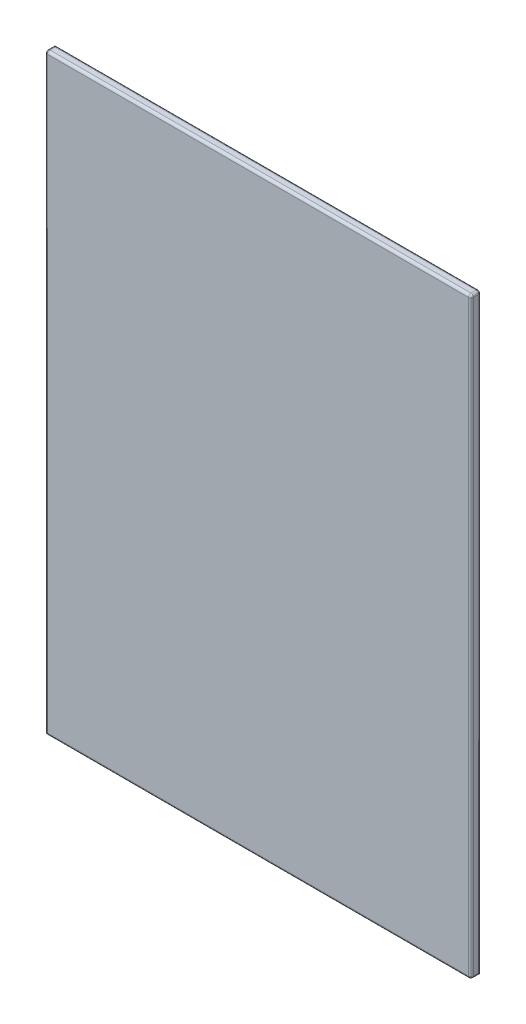
ISO-10303-21;
HEADER;
FILE_DESCRIPTION(('STEP AP214'),'2;1');
FILE_NAME('part.step','',(''),(''),'','','');
FILE_SCHEMA(('AUTOMOTIVE_DESIGN { 1 0 10303 214 1 1 1 1 }'));
ENDSEC;
DATA;
#1=APPLICATION_CONTEXT('core data for automotive mechanical design processes');
#2=APPLICATION_PROTOCOL_DEFINITION('international standard','automotive_design',2000,#1);
#3=PRODUCT_CONTEXT('',#1,'mechanical');
#4=PRODUCT('Part','Part','',(#3));
#5=PRODUCT_RELATED_PRODUCT_CATEGORY('part','',(#4));
#6=PRODUCT_DEFINITION_FORMATION('','',#4);
#7=PRODUCT_DEFINITION_CONTEXT('part definition',#1,'design');
#8=PRODUCT_DEFINITION('design','',#6,#7);
#9=PRODUCT_DEFINITION_SHAPE('','',#8);
#10=(LENGTH_UNIT() NAMED_UNIT(*) SI_UNIT(.MILLI.,.METRE.));
#11=(NAMED_UNIT(*) PLANE_ANGLE_UNIT() SI_UNIT($,.RADIAN.));
#12=(NAMED_UNIT(*) SI_UNIT($,.STERADIAN.) SOLID_ANGLE_UNIT());
#13=UNCERTAINTY_MEASURE_WITH_UNIT(LENGTH_MEASURE(1.E-05),#10,'distance_accuracy_value','');
#14=(GEOMETRIC_REPRESENTATION_CONTEXT(3) GLOBAL_UNCERTAINTY_ASSIGNED_CONTEXT((#13)) GLOBAL_UNIT_ASSIGNED_CONTEXT((#10,
#11,#12)) REPRESENTATION_CONTEXT('',''));
#15=CARTESIAN_POINT('',(0.,0.,0.));
#16=DIRECTION('',(0.,0.,1.));
#17=DIRECTION('',(1.,0.,0.));
#18=AXIS2_PLACEMENT_3D('',#15,#16,#17);
#19=CARTESIAN_POINT('',(427.5,595.,20.));
#20=DIRECTION('',(-1.,0.,0.));
#21=DIRECTION('',(0.,-1.,0.));
#22=AXIS2_PLACEMENT_3D('',#19,#20,#21);
#23=PLANE('',#22);
#24=DIRECTION('',(0.,1.,0.));
#25=VECTOR('',#24,1.);
#26=CARTESIAN_POINT('',(427.5,-595.,15.));
#27=LINE('',#26,#25);
#28=CARTESIAN_POINT('',(427.5,590.,15.));
#29=VERTEX_POINT('',#28);
#30=CARTESIAN_POINT('',(427.5,-590.,15.));
#31=VERTEX_POINT('',#30);
#32=EDGE_CURVE('E139',#29,#31,#27,.F.);
#33=ORIENTED_EDGE('',*,*,#32,.T.);
#34=DIRECTION('',(0.,0.,-1.));
#35=VECTOR('',#34,1.);
#36=CARTESIAN_POINT('',(427.5,-590.,20.));
#37=LINE('',#36,#35);
#38=CARTESIAN_POINT('',(427.5,-590.,5.));
#39=VERTEX_POINT('',#38);
#40=EDGE_CURVE('E146',#31,#39,#37,.T.);
#41=ORIENTED_EDGE('',*,*,#40,.T.);
#42=DIRECTION('',(0.,1.,0.));
#43=VECTOR('',#42,1.);
#44=CARTESIAN_POINT('',(427.5,595.,5.));
#45=LINE('',#44,#43);
#46=CARTESIAN_POINT('',(427.5,590.,5.));
#47=VERTEX_POINT('',#46);
#48=EDGE_CURVE('E142',#39,#47,#45,.T.);
#49=ORIENTED_EDGE('',*,*,#48,.T.);
#50=DIRECTION('',(0.,0.,-1.));
#51=VECTOR('',#50,1.);
#52=CARTESIAN_POINT('',(427.5,590.,20.));
#53=LINE('',#52,#51);
#54=EDGE_CURVE('E119',#47,#29,#53,.F.);
#55=ORIENTED_EDGE('',*,*,#54,.T.);
#56=EDGE_LOOP('',(#33,#41,#49,#55));
#57=FACE_BOUND('',#56,.T.);
#58=ADVANCED_FACE('F39',(#57),#23,.F.);
#59=CARTESIAN_POINT('',(-427.5,595.,20.));
#60=DIRECTION('',(0.,-1.,0.));
#61=DIRECTION('',(0.,0.,-1.));
#62=AXIS2_PLACEMENT_3D('',#59,#60,#61);
#63=PLANE('',#62);
#64=DIRECTION('',(-1.,0.,0.));
#65=VECTOR('',#64,1.);
#66=CARTESIAN_POINT('',(-427.5,595.,5.));
#67=LINE('',#66,#65);
#68=CARTESIAN_POINT('',(422.5,595.,5.));
#69=VERTEX_POINT('',#68);
#70=CARTESIAN_POINT('',(-422.5,595.,5.));
#71=VERTEX_POINT('',#70);
#72=EDGE_CURVE('E160',#69,#71,#67,.T.);
#73=ORIENTED_EDGE('',*,*,#72,.T.);
#74=DIRECTION('',(0.,0.,-1.));
#75=VECTOR('',#74,1.);
#76=CARTESIAN_POINT('',(-422.5,595.,20.));
#77=LINE('',#76,#75);
#78=CARTESIAN_POINT('',(-422.5,595.,15.));
#79=VERTEX_POINT('',#78);
#80=EDGE_CURVE('E164',#71,#79,#77,.F.);
#81=ORIENTED_EDGE('',*,*,#80,.T.);
#82=DIRECTION('',(-1.,0.,0.));
#83=VECTOR('',#82,1.);
#84=CARTESIAN_POINT('',(427.5,595.,15.));
#85=LINE('',#84,#83);
#86=CARTESIAN_POINT('',(422.5,595.,15.));
#87=VERTEX_POINT('',#86);
#88=EDGE_CURVE('E157',#79,#87,#85,.F.);
#89=ORIENTED_EDGE('',*,*,#88,.T.);
#90=DIRECTION('',(0.,0.,-1.));
#91=VECTOR('',#90,1.);
#92=CARTESIAN_POINT('',(422.5,595.,20.));
#93=LINE('',#92,#91);
#94=EDGE_CURVE('E154',#87,#69,#93,.T.);
#95=ORIENTED_EDGE('',*,*,#94,.T.);
#96=EDGE_LOOP('',(#73,#81,#89,#95));
#97=FACE_BOUND('',#96,.T.);
#98=ADVANCED_FACE('F291',(#97),#63,.F.);
#99=CARTESIAN_POINT('',(-427.5,595.,20.));
#100=DIRECTION('',(1.,0.,0.));
#101=DIRECTION('',(0.,1.,0.));
#102=AXIS2_PLACEMENT_3D('',#99,#100,#101);
#103=PLANE('',#102);
#104=DIRECTION('',(0.,0.,-1.));
#105=VECTOR('',#104,1.);
#106=CARTESIAN_POINT('',(-427.5,-595.,20.));
#107=LINE('',#106,#105);
#108=CARTESIAN_POINT('',(-427.5,-595.,15.));
#109=VERTEX_POINT('',#108);
#110=CARTESIAN_POINT('',(-427.5,-595.,0.));
#111=VERTEX_POINT('',#110);
#112=EDGE_CURVE('E113',#109,#111,#107,.T.);
#113=ORIENTED_EDGE('',*,*,#112,.F.);
#114=DIRECTION('',(0.,-1.,0.));
#115=VECTOR('',#114,1.);
#116=CARTESIAN_POINT('',(-427.5,595.,15.));
#117=LINE('',#116,#115);
#118=CARTESIAN_POINT('',(-427.5,590.,15.));
#119=VERTEX_POINT('',#118);
#120=EDGE_CURVE('E63',#109,#119,#117,.F.);
#121=ORIENTED_EDGE('',*,*,#120,.T.);
#122=DIRECTION('',(0.,0.,-1.));
#123=VECTOR('',#122,1.);
#124=CARTESIAN_POINT('',(-427.5,590.,20.));
#125=LINE('',#124,#123);
#126=CARTESIAN_POINT('',(-427.5,590.,0.));
#127=VERTEX_POINT('',#126);
#128=EDGE_CURVE('E125',#119,#127,#125,.T.);
#129=ORIENTED_EDGE('',*,*,#128,.T.);
#130=DIRECTION('',(0.,-1.,0.));
#131=VECTOR('',#130,1.);
#132=CARTESIAN_POINT('',(-427.5,595.,0.));
#133=LINE('',#132,#131);
#134=EDGE_CURVE('E122',#127,#111,#133,.T.);
#135=ORIENTED_EDGE('',*,*,#134,.T.);
#136=EDGE_LOOP('',(#113,#121,#129,#135));
#137=FACE_BOUND('',#136,.T.);
#138=ADVANCED_FACE('F123',(#137),#103,.F.);
#139=CARTESIAN_POINT('',(-427.5,-595.,20.));
#140=DIRECTION('',(0.,1.,0.));
#141=DIRECTION('',(0.,0.,1.));
#142=AXIS2_PLACEMENT_3D('',#139,#140,#141);
#143=PLANE('',#142);
#144=DIRECTION('',(0.,0.,-1.));
#145=VECTOR('',#144,1.);
#146=CARTESIAN_POINT('',(422.5,-595.,20.));
#147=LINE('',#146,#145);
#148=CARTESIAN_POINT('',(422.5,-595.,0.));
#149=VERTEX_POINT('',#148);
#150=CARTESIAN_POINT('',(422.5,-595.,15.));
#151=VERTEX_POINT('',#150);
#152=EDGE_CURVE('E49',#149,#151,#147,.F.);
#153=ORIENTED_EDGE('',*,*,#152,.T.);
#154=DIRECTION('',(1.,0.,0.));
#155=VECTOR('',#154,1.);
#156=CARTESIAN_POINT('',(-427.5,-595.,15.));
#157=LINE('',#156,#155);
#158=EDGE_CURVE('E11',#151,#109,#157,.F.);
#159=ORIENTED_EDGE('',*,*,#158,.T.);
#160=ORIENTED_EDGE('',*,*,#112,.T.);
#161=DIRECTION('',(1.,0.,0.));
#162=VECTOR('',#161,1.);
#163=CARTESIAN_POINT('',(-427.5,-595.,0.));
#164=LINE('',#163,#162);
#165=EDGE_CURVE('E117',#111,#149,#164,.T.);
#166=ORIENTED_EDGE('',*,*,#165,.T.);
#167=EDGE_LOOP('',(#153,#159,#160,#166));
#168=FACE_BOUND('',#167,.T.);
#169=ADVANCED_FACE('F115',(#168),#143,.F.);
#170=CARTESIAN_POINT('',(0.,0.,20.));
#171=DIRECTION('',(0.,0.,1.));
#172=DIRECTION('',(1.,0.,0.));
#173=AXIS2_PLACEMENT_3D('',#170,#171,#172);
#174=PLANE('',#173);
#175=DIRECTION('',(1.,0.,0.));
#176=VECTOR('',#175,1.);
#177=CARTESIAN_POINT('',(427.5,-590.,20.));
#178=LINE('',#177,#176);
#179=CARTESIAN_POINT('',(-422.5,-590.,20.));
#180=VERTEX_POINT('',#179);
#181=CARTESIAN_POINT('',(422.5,-590.,20.));
#182=VERTEX_POINT('',#181);
#183=EDGE_CURVE('E167',#180,#182,#178,.T.);
#184=ORIENTED_EDGE('',*,*,#183,.T.);
#185=DIRECTION('',(0.,1.,0.));
#186=VECTOR('',#185,1.);
#187=CARTESIAN_POINT('',(422.5,595.,20.));
#188=LINE('',#187,#186);
#189=CARTESIAN_POINT('',(422.5,590.,20.));
#190=VERTEX_POINT('',#189);
#191=EDGE_CURVE('E176',#182,#190,#188,.T.);
#192=ORIENTED_EDGE('',*,*,#191,.T.);
#193=DIRECTION('',(-1.,0.,0.));
#194=VECTOR('',#193,1.);
#195=CARTESIAN_POINT('',(-427.5,590.,20.));
#196=LINE('',#195,#194);
#197=CARTESIAN_POINT('',(-422.5,590.,20.));
#198=VERTEX_POINT('',#197);
#199=EDGE_CURVE('E173',#190,#198,#196,.T.);
#200=ORIENTED_EDGE('',*,*,#199,.T.);
#201=DIRECTION('',(0.,-1.,0.));
#202=VECTOR('',#201,1.);
#203=CARTESIAN_POINT('',(-422.5,-595.,20.));
#204=LINE('',#203,#202);
#205=EDGE_CURVE('E170',#198,#180,#204,.T.);
#206=ORIENTED_EDGE('',*,*,#205,.T.);
#207=EDGE_LOOP('',(#184,#192,#200,#206));
#208=FACE_BOUND('',#207,.T.);
#209=ADVANCED_FACE('F283',(#208),#174,.T.);
#210=CARTESIAN_POINT('',(0.,0.,0.));
#211=DIRECTION('',(0.,0.,1.));
#212=DIRECTION('',(1.,0.,0.));
#213=AXIS2_PLACEMENT_3D('',#210,#211,#212);
#214=PLANE('',#213);
#215=DIRECTION('',(-1.,0.,0.));
#216=VECTOR('',#215,1.);
#217=CARTESIAN_POINT('',(0.,590.,0.));
#218=LINE('',#217,#216);
#219=CARTESIAN_POINT('',(422.5,590.,0.));
#220=VERTEX_POINT('',#219);
#221=EDGE_CURVE('E149',#127,#220,#218,.F.);
#222=ORIENTED_EDGE('',*,*,#221,.T.);
#223=DIRECTION('',(0.,1.,0.));
#224=VECTOR('',#223,1.);
#225=CARTESIAN_POINT('',(422.5,0.,0.));
#226=LINE('',#225,#224);
#227=EDGE_CURVE('E133',#220,#149,#226,.F.);
#228=ORIENTED_EDGE('',*,*,#227,.T.);
#229=ORIENTED_EDGE('',*,*,#165,.F.);
#230=ORIENTED_EDGE('',*,*,#134,.F.);
#231=EDGE_LOOP('',(#222,#228,#229,#230));
#232=FACE_BOUND('',#231,.T.);
#233=ADVANCED_FACE('F131',(#232),#214,.F.);
#234=CARTESIAN_POINT('',(-422.5,0.,15.));
#235=DIRECTION('',(0.,1.,0.));
#236=DIRECTION('',(-1.,0.,0.));
#237=AXIS2_PLACEMENT_3D('',#234,#235,#236);
#238=CYLINDRICAL_SURFACE('',#237,5.);
#239=CARTESIAN_POINT('',(-422.5,-590.,15.));
#240=DIRECTION('',(-0.707106781186547,0.707106781186547,0.));
#241=DIRECTION('',(-0.707106781186547,-0.707106781186548,0.));
#242=AXIS2_PLACEMENT_3D('',#239,#240,#241);
#243=ELLIPSE('',#242,7.07106781186547,5.);
#244=EDGE_CURVE('E230',#180,#109,#243,.F.);
#245=ORIENTED_EDGE('',*,*,#244,.F.);
#246=ORIENTED_EDGE('',*,*,#205,.F.);
#247=CARTESIAN_POINT('',(-422.5,590.,15.));
#248=DIRECTION('',(0.,1.,0.));
#249=DIRECTION('',(0.,0.,1.));
#250=AXIS2_PLACEMENT_3D('',#247,#248,#249);
#251=CIRCLE('',#250,5.);
#252=EDGE_CURVE('E233',#119,#198,#251,.T.);
#253=ORIENTED_EDGE('',*,*,#252,.F.);
#254=ORIENTED_EDGE('',*,*,#120,.F.);
#255=EDGE_LOOP('',(#245,#246,#253,#254));
#256=FACE_BOUND('',#255,.T.);
#257=ADVANCED_FACE('F41',(#256),#238,.T.);
#258=CARTESIAN_POINT('',(0.,590.,15.));
#259=DIRECTION('',(1.,0.,0.));
#260=DIRECTION('',(0.,0.,-1.));
#261=AXIS2_PLACEMENT_3D('',#258,#259,#260);
#262=CYLINDRICAL_SURFACE('',#261,5.);
#263=CARTESIAN_POINT('',(-422.5,590.,15.));
#264=DIRECTION('',(-1.,0.,0.));
#265=DIRECTION('',(0.,0.,1.));
#266=AXIS2_PLACEMENT_3D('',#263,#264,#265);
#267=CIRCLE('',#266,5.);
#268=EDGE_CURVE('E43',#198,#79,#267,.T.);
#269=ORIENTED_EDGE('',*,*,#268,.F.);
#270=ORIENTED_EDGE('',*,*,#199,.F.);
#271=CARTESIAN_POINT('',(422.5,590.,15.));
#272=DIRECTION('',(1.,0.,0.));
#273=DIRECTION('',(0.,0.,-1.));
#274=AXIS2_PLACEMENT_3D('',#271,#272,#273);
#275=CIRCLE('',#274,5.);
#276=EDGE_CURVE('E223',#87,#190,#275,.T.);
#277=ORIENTED_EDGE('',*,*,#276,.F.);
#278=ORIENTED_EDGE('',*,*,#88,.F.);
#279=EDGE_LOOP('',(#269,#270,#277,#278));
#280=FACE_BOUND('',#279,.T.);
#281=ADVANCED_FACE('F286',(#280),#262,.T.);
#282=CARTESIAN_POINT('',(-422.5,590.,15.));
#283=DIRECTION('',(0.,0.,1.));
#284=DIRECTION('',(1.,0.,0.));
#285=AXIS2_PLACEMENT_3D('',#282,#283,#284);
#286=SPHERICAL_SURFACE('',#285,5.);
#287=ORIENTED_EDGE('',*,*,#252,.T.);
#288=ORIENTED_EDGE('',*,*,#268,.T.);
#289=CARTESIAN_POINT('',(-422.5,590.,15.));
#290=DIRECTION('',(0.,0.,1.));
#291=DIRECTION('',(1.,0.,0.));
#292=AXIS2_PLACEMENT_3D('',#289,#290,#291);
#293=CIRCLE('',#292,5.);
#294=EDGE_CURVE('E219',#119,#79,#293,.F.);
#295=ORIENTED_EDGE('',*,*,#294,.F.);
#296=EDGE_LOOP('',(#287,#288,#295));
#297=FACE_BOUND('',#296,.T.);
#298=ADVANCED_FACE('F241',(#297),#286,.T.);
#299=CARTESIAN_POINT('',(0.,-590.,15.));
#300=DIRECTION('',(-1.,0.,0.));
#301=DIRECTION('',(0.,0.,1.));
#302=AXIS2_PLACEMENT_3D('',#299,#300,#301);
#303=CYLINDRICAL_SURFACE('',#302,5.);
#304=ORIENTED_EDGE('',*,*,#244,.T.);
#305=ORIENTED_EDGE('',*,*,#158,.F.);
#306=CARTESIAN_POINT('',(422.5,-590.,15.));
#307=DIRECTION('',(1.,0.,0.));
#308=DIRECTION('',(0.,1.,0.));
#309=AXIS2_PLACEMENT_3D('',#306,#307,#308);
#310=CIRCLE('',#309,5.);
#311=EDGE_CURVE('E215',#182,#151,#310,.T.);
#312=ORIENTED_EDGE('',*,*,#311,.F.);
#313=ORIENTED_EDGE('',*,*,#183,.F.);
#314=EDGE_LOOP('',(#304,#305,#312,#313));
#315=FACE_BOUND('',#314,.T.);
#316=ADVANCED_FACE('F278',(#315),#303,.T.);
#317=CARTESIAN_POINT('',(422.5,0.,15.));
#318=DIRECTION('',(0.,-1.,0.));
#319=DIRECTION('',(1.,0.,0.));
#320=AXIS2_PLACEMENT_3D('',#317,#318,#319);
#321=CYLINDRICAL_SURFACE('',#320,5.);
#322=CARTESIAN_POINT('',(422.5,590.,15.));
#323=DIRECTION('',(0.,1.,0.));
#324=DIRECTION('',(0.,0.,1.));
#325=AXIS2_PLACEMENT_3D('',#322,#323,#324);
#326=CIRCLE('',#325,5.);
#327=EDGE_CURVE('E226',#190,#29,#326,.T.);
#328=ORIENTED_EDGE('',*,*,#327,.F.);
#329=ORIENTED_EDGE('',*,*,#191,.F.);
#330=CARTESIAN_POINT('',(422.5,-590.,15.));
#331=DIRECTION('',(0.,-1.,0.));
#332=DIRECTION('',(0.,0.,-1.));
#333=AXIS2_PLACEMENT_3D('',#330,#331,#332);
#334=CIRCLE('',#333,5.);
#335=EDGE_CURVE('E211',#31,#182,#334,.T.);
#336=ORIENTED_EDGE('',*,*,#335,.F.);
#337=ORIENTED_EDGE('',*,*,#32,.F.);
#338=EDGE_LOOP('',(#328,#329,#336,#337));
#339=FACE_BOUND('',#338,.T.);
#340=ADVANCED_FACE('F318',(#339),#321,.T.);
#341=CARTESIAN_POINT('',(422.5,590.,15.));
#342=DIRECTION('',(0.,0.,1.));
#343=DIRECTION('',(1.,0.,0.));
#344=AXIS2_PLACEMENT_3D('',#341,#342,#343);
#345=SPHERICAL_SURFACE('',#344,5.);
#346=ORIENTED_EDGE('',*,*,#276,.T.);
#347=ORIENTED_EDGE('',*,*,#327,.T.);
#348=CARTESIAN_POINT('',(422.5,590.,15.));
#349=DIRECTION('',(0.,0.,1.));
#350=DIRECTION('',(1.,0.,0.));
#351=AXIS2_PLACEMENT_3D('',#348,#349,#350);
#352=CIRCLE('',#351,5.);
#353=EDGE_CURVE('E207',#87,#29,#352,.F.);
#354=ORIENTED_EDGE('',*,*,#353,.F.);
#355=EDGE_LOOP('',(#346,#347,#354));
#356=FACE_BOUND('',#355,.T.);
#357=ADVANCED_FACE('F289',(#356),#345,.T.);
#358=CARTESIAN_POINT('',(-422.5,590.,20.));
#359=DIRECTION('',(0.,0.,-1.));
#360=DIRECTION('',(-1.,0.,0.));
#361=AXIS2_PLACEMENT_3D('',#358,#359,#360);
#362=CYLINDRICAL_SURFACE('',#361,5.);
#363=ORIENTED_EDGE('',*,*,#294,.T.);
#364=ORIENTED_EDGE('',*,*,#80,.F.);
#365=CARTESIAN_POINT('',(-422.5,590.,5.));
#366=DIRECTION('',(0.707106781186547,0.,-0.707106781186547));
#367=DIRECTION('',(-0.707106781186547,0.,-0.707106781186547));
#368=AXIS2_PLACEMENT_3D('',#365,#366,#367);
#369=ELLIPSE('',#368,7.07106781186547,5.);
#370=EDGE_CURVE('E204',#127,#71,#369,.T.);
#371=ORIENTED_EDGE('',*,*,#370,.F.);
#372=ORIENTED_EDGE('',*,*,#128,.F.);
#373=EDGE_LOOP('',(#363,#364,#371,#372));
#374=FACE_BOUND('',#373,.T.);
#375=ADVANCED_FACE('F247',(#374),#362,.T.);
#376=CARTESIAN_POINT('',(422.5,-590.,15.));
#377=DIRECTION('',(0.,0.,1.));
#378=DIRECTION('',(1.,0.,0.));
#379=AXIS2_PLACEMENT_3D('',#376,#377,#378);
#380=SPHERICAL_SURFACE('',#379,5.);
#381=ORIENTED_EDGE('',*,*,#335,.T.);
#382=ORIENTED_EDGE('',*,*,#311,.T.);
#383=CARTESIAN_POINT('',(422.5,-590.,15.));
#384=DIRECTION('',(0.,0.,1.));
#385=DIRECTION('',(1.,0.,0.));
#386=AXIS2_PLACEMENT_3D('',#383,#384,#385);
#387=CIRCLE('',#386,5.);
#388=EDGE_CURVE('E200',#31,#151,#387,.F.);
#389=ORIENTED_EDGE('',*,*,#388,.F.);
#390=EDGE_LOOP('',(#381,#382,#389));
#391=FACE_BOUND('',#390,.T.);
#392=ADVANCED_FACE('F274',(#391),#380,.T.);
#393=CARTESIAN_POINT('',(422.5,590.,20.));
#394=DIRECTION('',(0.,0.,-1.));
#395=DIRECTION('',(-1.,0.,0.));
#396=AXIS2_PLACEMENT_3D('',#393,#394,#395);
#397=CYLINDRICAL_SURFACE('',#396,5.);
#398=ORIENTED_EDGE('',*,*,#353,.T.);
#399=ORIENTED_EDGE('',*,*,#54,.F.);
#400=CARTESIAN_POINT('',(422.5,590.,5.));
#401=DIRECTION('',(0.,0.,-1.));
#402=DIRECTION('',(-1.,0.,0.));
#403=AXIS2_PLACEMENT_3D('',#400,#401,#402);
#404=CIRCLE('',#403,5.);
#405=EDGE_CURVE('E196',#69,#47,#404,.T.);
#406=ORIENTED_EDGE('',*,*,#405,.F.);
#407=ORIENTED_EDGE('',*,*,#94,.F.);
#408=EDGE_LOOP('',(#398,#399,#406,#407));
#409=FACE_BOUND('',#408,.T.);
#410=ADVANCED_FACE('F264',(#409),#397,.T.);
#411=CARTESIAN_POINT('',(-427.5,590.,5.));
#412=DIRECTION('',(-1.,0.,0.));
#413=DIRECTION('',(0.,0.,1.));
#414=AXIS2_PLACEMENT_3D('',#411,#412,#413);
#415=CYLINDRICAL_SURFACE('',#414,5.);
#416=ORIENTED_EDGE('',*,*,#370,.T.);
#417=ORIENTED_EDGE('',*,*,#72,.F.);
#418=CARTESIAN_POINT('',(422.5,590.,5.));
#419=DIRECTION('',(1.,0.,0.));
#420=DIRECTION('',(0.,1.,0.));
#421=AXIS2_PLACEMENT_3D('',#418,#419,#420);
#422=CIRCLE('',#421,5.);
#423=EDGE_CURVE('E192',#220,#69,#422,.T.);
#424=ORIENTED_EDGE('',*,*,#423,.F.);
#425=ORIENTED_EDGE('',*,*,#221,.F.);
#426=EDGE_LOOP('',(#416,#417,#424,#425));
#427=FACE_BOUND('',#426,.T.);
#428=ADVANCED_FACE('F252',(#427),#415,.T.);
#429=CARTESIAN_POINT('',(422.5,-590.,20.));
#430=DIRECTION('',(0.,0.,-1.));
#431=DIRECTION('',(-1.,0.,0.));
#432=AXIS2_PLACEMENT_3D('',#429,#430,#431);
#433=CYLINDRICAL_SURFACE('',#432,5.);
#434=ORIENTED_EDGE('',*,*,#388,.T.);
#435=ORIENTED_EDGE('',*,*,#152,.F.);
#436=CARTESIAN_POINT('',(422.5,-590.,5.));
#437=DIRECTION('',(0.,0.707106781186547,-0.707106781186547));
#438=DIRECTION('',(0.,-0.707106781186547,-0.707106781186547));
#439=AXIS2_PLACEMENT_3D('',#436,#437,#438);
#440=ELLIPSE('',#439,7.07106781186547,5.);
#441=EDGE_CURVE('E189',#39,#149,#440,.T.);
#442=ORIENTED_EDGE('',*,*,#441,.F.);
#443=ORIENTED_EDGE('',*,*,#40,.F.);
#444=EDGE_LOOP('',(#434,#435,#442,#443));
#445=FACE_BOUND('',#444,.T.);
#446=ADVANCED_FACE('F271',(#445),#433,.T.);
#447=CARTESIAN_POINT('',(422.5,590.,5.));
#448=DIRECTION('',(0.,1.,0.));
#449=DIRECTION('',(-1.,0.,0.));
#450=AXIS2_PLACEMENT_3D('',#447,#448,#449);
#451=SPHERICAL_SURFACE('',#450,5.);
#452=ORIENTED_EDGE('',*,*,#423,.T.);
#453=ORIENTED_EDGE('',*,*,#405,.T.);
#454=CARTESIAN_POINT('',(422.5,590.,5.));
#455=DIRECTION('',(0.,1.,0.));
#456=DIRECTION('',(0.,0.,1.));
#457=AXIS2_PLACEMENT_3D('',#454,#455,#456);
#458=CIRCLE('',#457,5.);
#459=EDGE_CURVE('E186',#220,#47,#458,.F.);
#460=ORIENTED_EDGE('',*,*,#459,.F.);
#461=EDGE_LOOP('',(#452,#453,#460));
#462=FACE_BOUND('',#461,.T.);
#463=ADVANCED_FACE('F260',(#462),#451,.T.);
#464=CARTESIAN_POINT('',(422.5,595.,5.));
#465=DIRECTION('',(0.,1.,0.));
#466=DIRECTION('',(-1.,0.,0.));
#467=AXIS2_PLACEMENT_3D('',#464,#465,#466);
#468=CYLINDRICAL_SURFACE('',#467,5.);
#469=ORIENTED_EDGE('',*,*,#441,.T.);
#470=ORIENTED_EDGE('',*,*,#227,.F.);
#471=ORIENTED_EDGE('',*,*,#459,.T.);
#472=ORIENTED_EDGE('',*,*,#48,.F.);
#473=EDGE_LOOP('',(#469,#470,#471,#472));
#474=FACE_BOUND('',#473,.T.);
#475=ADVANCED_FACE('F257',(#474),#468,.T.);
#476=CLOSED_SHELL('',(#58,#98,#138,#169,#209,#233,#257,#281,#298,#316,#340,#357,#375,#392,#410,
#428,#446,#463,#475));
#477=MANIFOLD_SOLID_BREP('B2',#476);
#478=ADVANCED_BREP_SHAPE_REPRESENTATION('',(#18,#477),#14);
#479=SHAPE_DEFINITION_REPRESENTATION(#9,#478);
ENDSEC;
END-ISO-10303-21;
